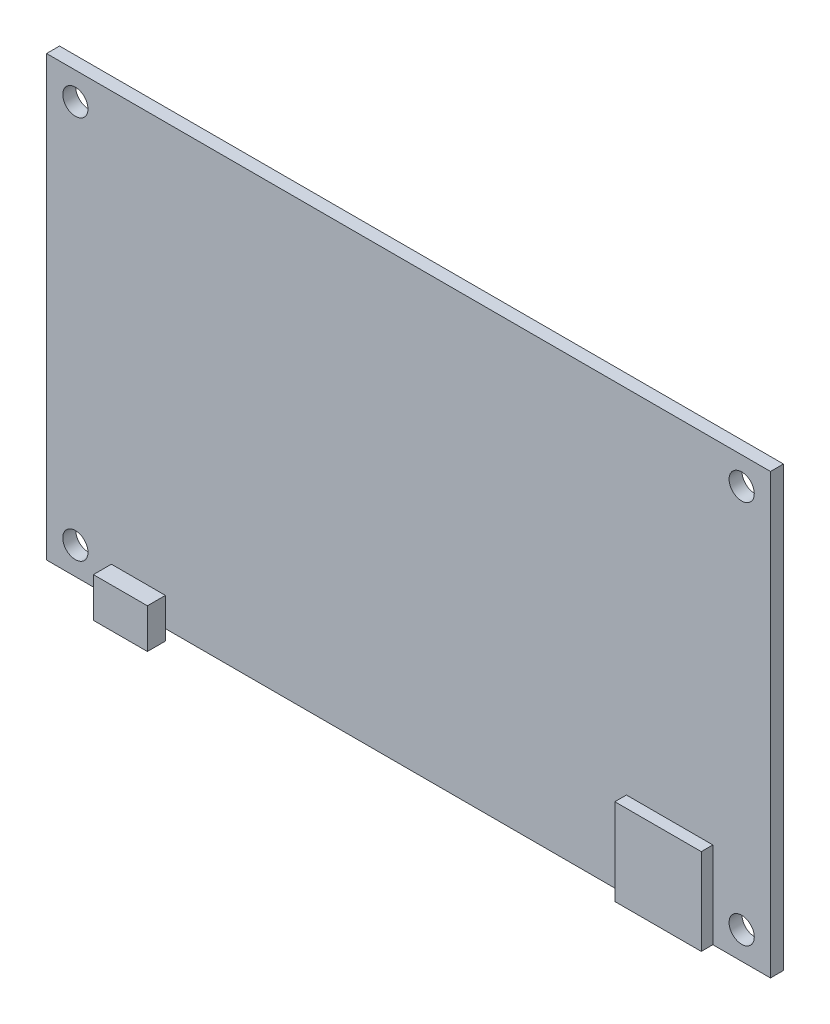
ISO-10303-21;
HEADER;
FILE_DESCRIPTION(('STEP AP214'),'2;1');
FILE_NAME('part.step','',(''),(''),'','','');
FILE_SCHEMA(('AUTOMOTIVE_DESIGN { 1 0 10303 214 1 1 1 1 }'));
ENDSEC;
DATA;
#1=APPLICATION_CONTEXT('core data for automotive mechanical design processes');
#2=APPLICATION_PROTOCOL_DEFINITION('international standard','automotive_design',2000,#1);
#3=PRODUCT_CONTEXT('',#1,'mechanical');
#4=PRODUCT('Part','Part','',(#3));
#5=PRODUCT_RELATED_PRODUCT_CATEGORY('part','',(#4));
#6=PRODUCT_DEFINITION_FORMATION('','',#4);
#7=PRODUCT_DEFINITION_CONTEXT('part definition',#1,'design');
#8=PRODUCT_DEFINITION('design','',#6,#7);
#9=PRODUCT_DEFINITION_SHAPE('','',#8);
#10=(LENGTH_UNIT() NAMED_UNIT(*) SI_UNIT(.MILLI.,.METRE.));
#11=(NAMED_UNIT(*) PLANE_ANGLE_UNIT() SI_UNIT($,.RADIAN.));
#12=(NAMED_UNIT(*) SI_UNIT($,.STERADIAN.) SOLID_ANGLE_UNIT());
#13=UNCERTAINTY_MEASURE_WITH_UNIT(LENGTH_MEASURE(1.E-05),#10,'distance_accuracy_value','');
#14=(GEOMETRIC_REPRESENTATION_CONTEXT(3) GLOBAL_UNCERTAINTY_ASSIGNED_CONTEXT((#13)) GLOBAL_UNIT_ASSIGNED_CONTEXT((#10,
#11,#12)) REPRESENTATION_CONTEXT('',''));
#15=CARTESIAN_POINT('',(0.,0.,0.));
#16=DIRECTION('',(0.,0.,1.));
#17=DIRECTION('',(1.,0.,0.));
#18=AXIS2_PLACEMENT_3D('',#15,#16,#17);
#19=CARTESIAN_POINT('',(-50.25,0.,1.8));
#20=DIRECTION('',(0.,0.,1.));
#21=DIRECTION('',(1.,0.,0.));
#22=AXIS2_PLACEMENT_3D('',#19,#20,#21);
#23=PLANE('',#22);
#24=CARTESIAN_POINT('',(46.25,57.1,1.8));
#25=DIRECTION('',(0.,0.,-1.));
#26=DIRECTION('',(1.,0.,0.));
#27=AXIS2_PLACEMENT_3D('',#24,#25,#26);
#28=CIRCLE('',#27,1.75);
#29=CARTESIAN_POINT('',(48.,57.1,1.8));
#30=VERTEX_POINT('',#29);
#31=EDGE_CURVE('E275',#30,#30,#28,.T.);
#32=ORIENTED_EDGE('',*,*,#31,.T.);
#33=EDGE_LOOP('',(#32));
#34=FACE_BOUND('',#33,.T.);
#35=CARTESIAN_POINT('',(-46.25,3.8,1.8));
#36=DIRECTION('',(0.,0.,1.));
#37=DIRECTION('',(1.,0.,0.));
#38=AXIS2_PLACEMENT_3D('',#35,#36,#37);
#39=CIRCLE('',#38,1.75);
#40=CARTESIAN_POINT('',(-44.5,3.8,1.8));
#41=VERTEX_POINT('',#40);
#42=EDGE_CURVE('E295',#41,#41,#39,.T.);
#43=ORIENTED_EDGE('',*,*,#42,.F.);
#44=EDGE_LOOP('',(#43));
#45=FACE_BOUND('',#44,.T.);
#46=CARTESIAN_POINT('',(-46.25,57.1,1.8));
#47=DIRECTION('',(0.,0.,1.));
#48=DIRECTION('',(-1.,0.,0.));
#49=AXIS2_PLACEMENT_3D('',#46,#47,#48);
#50=CIRCLE('',#49,1.75);
#51=CARTESIAN_POINT('',(-48.,57.1,1.8));
#52=VERTEX_POINT('',#51);
#53=EDGE_CURVE('E287',#52,#52,#50,.T.);
#54=ORIENTED_EDGE('',*,*,#53,.F.);
#55=EDGE_LOOP('',(#54));
#56=FACE_BOUND('',#55,.T.);
#57=CARTESIAN_POINT('',(46.25,3.8,1.8));
#58=DIRECTION('',(0.,0.,-1.));
#59=DIRECTION('',(-1.,0.,0.));
#60=AXIS2_PLACEMENT_3D('',#57,#58,#59);
#61=CIRCLE('',#60,1.75);
#62=CARTESIAN_POINT('',(44.5,3.8,1.8));
#63=VERTEX_POINT('',#62);
#64=EDGE_CURVE('E284',#63,#63,#61,.T.);
#65=ORIENTED_EDGE('',*,*,#64,.T.);
#66=EDGE_LOOP('',(#65));
#67=FACE_BOUND('',#66,.T.);
#68=DIRECTION('',(1.,0.,0.));
#69=VECTOR('',#68,1.);
#70=CARTESIAN_POINT('',(-50.25,0.,1.8));
#71=LINE('',#70,#69);
#72=CARTESIAN_POINT('',(-50.25,0.,1.8));
#73=VERTEX_POINT('',#72);
#74=CARTESIAN_POINT('',(-41.25,0.,1.8));
#75=VERTEX_POINT('',#74);
#76=EDGE_CURVE('E192',#73,#75,#71,.T.);
#77=ORIENTED_EDGE('',*,*,#76,.T.);
#78=DIRECTION('',(0.,-1.,0.));
#79=VECTOR('',#78,1.);
#80=CARTESIAN_POINT('',(-41.25,-1.5,1.8));
#81=LINE('',#80,#79);
#82=CARTESIAN_POINT('',(-41.25,4.,1.8));
#83=VERTEX_POINT('',#82);
#84=EDGE_CURVE('E59',#83,#75,#81,.T.);
#85=ORIENTED_EDGE('',*,*,#84,.F.);
#86=DIRECTION('',(-1.,0.,0.));
#87=VECTOR('',#86,1.);
#88=CARTESIAN_POINT('',(-41.25,4.,1.8));
#89=LINE('',#88,#87);
#90=CARTESIAN_POINT('',(-33.75,4.,1.8));
#91=VERTEX_POINT('',#90);
#92=EDGE_CURVE('E54',#91,#83,#89,.T.);
#93=ORIENTED_EDGE('',*,*,#92,.F.);
#94=DIRECTION('',(0.,1.,0.));
#95=VECTOR('',#94,1.);
#96=CARTESIAN_POINT('',(-33.75,-1.5,1.8));
#97=LINE('',#96,#95);
#98=CARTESIAN_POINT('',(-33.75,0.,1.8));
#99=VERTEX_POINT('',#98);
#100=EDGE_CURVE('E141',#99,#91,#97,.T.);
#101=ORIENTED_EDGE('',*,*,#100,.F.);
#102=CARTESIAN_POINT('',(30.25,0.,1.8));
#103=VERTEX_POINT('',#102);
#104=EDGE_CURVE('E40',#99,#103,#71,.T.);
#105=ORIENTED_EDGE('',*,*,#104,.T.);
#106=DIRECTION('',(0.,-1.,0.));
#107=VECTOR('',#106,1.);
#108=CARTESIAN_POINT('',(30.25,0.,1.8));
#109=LINE('',#108,#107);
#110=CARTESIAN_POINT('',(30.25,12.,1.8));
#111=VERTEX_POINT('',#110);
#112=EDGE_CURVE('E160',#111,#103,#109,.T.);
#113=ORIENTED_EDGE('',*,*,#112,.F.);
#114=DIRECTION('',(-1.,0.,0.));
#115=VECTOR('',#114,1.);
#116=CARTESIAN_POINT('',(30.25,12.,1.8));
#117=LINE('',#116,#115);
#118=CARTESIAN_POINT('',(42.25,12.,1.8));
#119=VERTEX_POINT('',#118);
#120=EDGE_CURVE('E175',#119,#111,#117,.T.);
#121=ORIENTED_EDGE('',*,*,#120,.F.);
#122=DIRECTION('',(0.,1.,0.));
#123=VECTOR('',#122,1.);
#124=CARTESIAN_POINT('',(42.25,0.,1.8));
#125=LINE('',#124,#123);
#126=CARTESIAN_POINT('',(42.25,0.,1.8));
#127=VERTEX_POINT('',#126);
#128=EDGE_CURVE('E262',#127,#119,#125,.T.);
#129=ORIENTED_EDGE('',*,*,#128,.F.);
#130=CARTESIAN_POINT('',(50.25,0.,1.8));
#131=VERTEX_POINT('',#130);
#132=EDGE_CURVE('E203',#127,#131,#71,.T.);
#133=ORIENTED_EDGE('',*,*,#132,.T.);
#134=DIRECTION('',(0.,1.,0.));
#135=VECTOR('',#134,1.);
#136=CARTESIAN_POINT('',(50.25,60.9,1.8));
#137=LINE('',#136,#135);
#138=CARTESIAN_POINT('',(50.25,60.9,1.8));
#139=VERTEX_POINT('',#138);
#140=EDGE_CURVE('E198',#131,#139,#137,.T.);
#141=ORIENTED_EDGE('',*,*,#140,.T.);
#142=DIRECTION('',(-1.,0.,0.));
#143=VECTOR('',#142,1.);
#144=CARTESIAN_POINT('',(-50.25,60.9,1.8));
#145=LINE('',#144,#143);
#146=CARTESIAN_POINT('',(-50.25,60.9,1.8));
#147=VERTEX_POINT('',#146);
#148=EDGE_CURVE('E216',#139,#147,#145,.T.);
#149=ORIENTED_EDGE('',*,*,#148,.T.);
#150=DIRECTION('',(0.,-1.,0.));
#151=VECTOR('',#150,1.);
#152=CARTESIAN_POINT('',(-50.25,60.9,1.8));
#153=LINE('',#152,#151);
#154=EDGE_CURVE('E196',#147,#73,#153,.T.);
#155=ORIENTED_EDGE('',*,*,#154,.T.);
#156=EDGE_LOOP('',(#77,#85,#93,#101,#105,#113,#121,#129,#133,#141,#149,#155));
#157=FACE_BOUND('',#156,.T.);
#158=ADVANCED_FACE('F36',(#34,#45,#56,#67,#157),#23,.T.);
#159=CARTESIAN_POINT('',(-50.25,0.,0.));
#160=DIRECTION('',(0.,0.,1.));
#161=DIRECTION('',(1.,0.,0.));
#162=AXIS2_PLACEMENT_3D('',#159,#160,#161);
#163=PLANE('',#162);
#164=CARTESIAN_POINT('',(46.25,3.8,0.));
#165=DIRECTION('',(0.,0.,1.));
#166=DIRECTION('',(1.,0.,0.));
#167=AXIS2_PLACEMENT_3D('',#164,#165,#166);
#168=CIRCLE('',#167,1.75);
#169=CARTESIAN_POINT('',(48.,3.8,0.));
#170=VERTEX_POINT('',#169);
#171=EDGE_CURVE('E282',#170,#170,#168,.T.);
#172=ORIENTED_EDGE('',*,*,#171,.T.);
#173=EDGE_LOOP('',(#172));
#174=FACE_BOUND('',#173,.T.);
#175=CARTESIAN_POINT('',(-46.25,57.1,0.));
#176=DIRECTION('',(0.,0.,1.));
#177=DIRECTION('',(1.,0.,0.));
#178=AXIS2_PLACEMENT_3D('',#175,#176,#177);
#179=CIRCLE('',#178,1.75);
#180=CARTESIAN_POINT('',(-44.5,57.1,0.));
#181=VERTEX_POINT('',#180);
#182=EDGE_CURVE('E292',#181,#181,#179,.F.);
#183=ORIENTED_EDGE('',*,*,#182,.F.);
#184=EDGE_LOOP('',(#183));
#185=FACE_BOUND('',#184,.T.);
#186=CARTESIAN_POINT('',(-46.25,3.8,0.));
#187=DIRECTION('',(0.,0.,1.));
#188=DIRECTION('',(1.,0.,0.));
#189=AXIS2_PLACEMENT_3D('',#186,#187,#188);
#190=CIRCLE('',#189,1.75);
#191=CARTESIAN_POINT('',(-44.5,3.8,0.));
#192=VERTEX_POINT('',#191);
#193=EDGE_CURVE('E225',#192,#192,#190,.F.);
#194=ORIENTED_EDGE('',*,*,#193,.F.);
#195=EDGE_LOOP('',(#194));
#196=FACE_BOUND('',#195,.T.);
#197=DIRECTION('',(0.,-1.,0.));
#198=VECTOR('',#197,1.);
#199=CARTESIAN_POINT('',(-50.25,60.9,0.));
#200=LINE('',#199,#198);
#201=CARTESIAN_POINT('',(-50.25,60.9,0.));
#202=VERTEX_POINT('',#201);
#203=CARTESIAN_POINT('',(-50.25,0.,0.));
#204=VERTEX_POINT('',#203);
#205=EDGE_CURVE('E223',#202,#204,#200,.T.);
#206=ORIENTED_EDGE('',*,*,#205,.F.);
#207=DIRECTION('',(-1.,0.,0.));
#208=VECTOR('',#207,1.);
#209=CARTESIAN_POINT('',(-50.25,60.9,0.));
#210=LINE('',#209,#208);
#211=CARTESIAN_POINT('',(50.25,60.9,0.));
#212=VERTEX_POINT('',#211);
#213=EDGE_CURVE('E217',#212,#202,#210,.T.);
#214=ORIENTED_EDGE('',*,*,#213,.F.);
#215=DIRECTION('',(0.,1.,0.));
#216=VECTOR('',#215,1.);
#217=CARTESIAN_POINT('',(50.25,60.9,0.));
#218=LINE('',#217,#216);
#219=CARTESIAN_POINT('',(50.25,0.,0.));
#220=VERTEX_POINT('',#219);
#221=EDGE_CURVE('E219',#220,#212,#218,.T.);
#222=ORIENTED_EDGE('',*,*,#221,.F.);
#223=DIRECTION('',(1.,0.,0.));
#224=VECTOR('',#223,1.);
#225=CARTESIAN_POINT('',(-50.25,0.,0.));
#226=LINE('',#225,#224);
#227=EDGE_CURVE('E221',#204,#220,#226,.T.);
#228=ORIENTED_EDGE('',*,*,#227,.F.);
#229=EDGE_LOOP('',(#206,#214,#222,#228));
#230=FACE_BOUND('',#229,.T.);
#231=CARTESIAN_POINT('',(46.25,57.1,0.));
#232=DIRECTION('',(0.,0.,1.));
#233=DIRECTION('',(1.,0.,0.));
#234=AXIS2_PLACEMENT_3D('',#231,#232,#233);
#235=CIRCLE('',#234,1.75);
#236=CARTESIAN_POINT('',(48.,57.1,0.));
#237=VERTEX_POINT('',#236);
#238=EDGE_CURVE('E273',#237,#237,#235,.T.);
#239=ORIENTED_EDGE('',*,*,#238,.T.);
#240=EDGE_LOOP('',(#239));
#241=FACE_BOUND('',#240,.T.);
#242=ADVANCED_FACE('F302',(#174,#185,#196,#230,#241),#163,.F.);
#243=CARTESIAN_POINT('',(-50.25,60.9,1.8));
#244=DIRECTION('',(1.,0.,0.));
#245=DIRECTION('',(0.,1.,0.));
#246=AXIS2_PLACEMENT_3D('',#243,#244,#245);
#247=PLANE('',#246);
#248=ORIENTED_EDGE('',*,*,#205,.T.);
#249=DIRECTION('',(0.,0.,-1.));
#250=VECTOR('',#249,1.);
#251=CARTESIAN_POINT('',(-50.25,0.,1.8));
#252=LINE('',#251,#250);
#253=EDGE_CURVE('E12',#73,#204,#252,.T.);
#254=ORIENTED_EDGE('',*,*,#253,.F.);
#255=ORIENTED_EDGE('',*,*,#154,.F.);
#256=DIRECTION('',(0.,0.,-1.));
#257=VECTOR('',#256,1.);
#258=CARTESIAN_POINT('',(-50.25,60.9,1.8));
#259=LINE('',#258,#257);
#260=EDGE_CURVE('E213',#147,#202,#259,.T.);
#261=ORIENTED_EDGE('',*,*,#260,.T.);
#262=EDGE_LOOP('',(#248,#254,#255,#261));
#263=FACE_BOUND('',#262,.T.);
#264=ADVANCED_FACE('F38',(#263),#247,.F.);
#265=CARTESIAN_POINT('',(-50.25,0.,1.8));
#266=DIRECTION('',(0.,1.,0.));
#267=DIRECTION('',(0.,0.,1.));
#268=AXIS2_PLACEMENT_3D('',#265,#266,#267);
#269=PLANE('',#268);
#270=ORIENTED_EDGE('',*,*,#227,.T.);
#271=DIRECTION('',(0.,0.,-1.));
#272=VECTOR('',#271,1.);
#273=CARTESIAN_POINT('',(50.25,0.,1.8));
#274=LINE('',#273,#272);
#275=EDGE_CURVE('E46',#131,#220,#274,.T.);
#276=ORIENTED_EDGE('',*,*,#275,.F.);
#277=ORIENTED_EDGE('',*,*,#132,.F.);
#278=DIRECTION('',(0.,0.,-1.));
#279=VECTOR('',#278,1.);
#280=CARTESIAN_POINT('',(42.25,0.,23.7905627484771));
#281=LINE('',#280,#279);
#282=CARTESIAN_POINT('',(42.25,0.,3.41));
#283=VERTEX_POINT('',#282);
#284=EDGE_CURVE('E253',#283,#127,#281,.T.);
#285=ORIENTED_EDGE('',*,*,#284,.F.);
#286=DIRECTION('',(1.,0.,0.));
#287=VECTOR('',#286,1.);
#288=CARTESIAN_POINT('',(30.25,0.,3.41));
#289=LINE('',#288,#287);
#290=CARTESIAN_POINT('',(30.25,0.,3.41));
#291=VERTEX_POINT('',#290);
#292=EDGE_CURVE('E249',#291,#283,#289,.T.);
#293=ORIENTED_EDGE('',*,*,#292,.F.);
#294=DIRECTION('',(0.,0.,-1.));
#295=VECTOR('',#294,1.);
#296=CARTESIAN_POINT('',(30.25,0.,23.7905627484771));
#297=LINE('',#296,#295);
#298=EDGE_CURVE('E187',#291,#103,#297,.T.);
#299=ORIENTED_EDGE('',*,*,#298,.T.);
#300=ORIENTED_EDGE('',*,*,#104,.F.);
#301=EDGE_CURVE('E190',#75,#99,#71,.T.);
#302=ORIENTED_EDGE('',*,*,#301,.F.);
#303=ORIENTED_EDGE('',*,*,#76,.F.);
#304=ORIENTED_EDGE('',*,*,#253,.T.);
#305=EDGE_LOOP('',(#270,#276,#277,#285,#293,#299,#300,#302,#303,#304));
#306=FACE_BOUND('',#305,.T.);
#307=ADVANCED_FACE('F246',(#306),#269,.F.);
#308=CARTESIAN_POINT('',(50.25,60.9,1.8));
#309=DIRECTION('',(-1.,0.,0.));
#310=DIRECTION('',(0.,0.,1.));
#311=AXIS2_PLACEMENT_3D('',#308,#309,#310);
#312=PLANE('',#311);
#313=ORIENTED_EDGE('',*,*,#221,.T.);
#314=DIRECTION('',(0.,0.,-1.));
#315=VECTOR('',#314,1.);
#316=CARTESIAN_POINT('',(50.25,60.9,1.8));
#317=LINE('',#316,#315);
#318=EDGE_CURVE('E210',#139,#212,#317,.T.);
#319=ORIENTED_EDGE('',*,*,#318,.F.);
#320=ORIENTED_EDGE('',*,*,#140,.F.);
#321=ORIENTED_EDGE('',*,*,#275,.T.);
#322=EDGE_LOOP('',(#313,#319,#320,#321));
#323=FACE_BOUND('',#322,.T.);
#324=ADVANCED_FACE('F234',(#323),#312,.F.);
#325=CARTESIAN_POINT('',(-50.25,60.9,1.8));
#326=DIRECTION('',(0.,-1.,0.));
#327=DIRECTION('',(0.,0.,-1.));
#328=AXIS2_PLACEMENT_3D('',#325,#326,#327);
#329=PLANE('',#328);
#330=ORIENTED_EDGE('',*,*,#213,.T.);
#331=ORIENTED_EDGE('',*,*,#260,.F.);
#332=ORIENTED_EDGE('',*,*,#148,.F.);
#333=ORIENTED_EDGE('',*,*,#318,.T.);
#334=EDGE_LOOP('',(#330,#331,#332,#333));
#335=FACE_BOUND('',#334,.T.);
#336=ADVANCED_FACE('F238',(#335),#329,.F.);
#337=CARTESIAN_POINT('',(-46.25,3.8,-0.000999999999999916));
#338=DIRECTION('',(0.,0.,1.));
#339=DIRECTION('',(1.,0.,0.));
#340=AXIS2_PLACEMENT_3D('',#337,#338,#339);
#341=CYLINDRICAL_SURFACE('',#340,1.75);
#342=ORIENTED_EDGE('',*,*,#42,.T.);
#343=EDGE_LOOP('',(#342));
#344=FACE_BOUND('',#343,.T.);
#345=ORIENTED_EDGE('',*,*,#193,.T.);
#346=EDGE_LOOP('',(#345));
#347=FACE_BOUND('',#346,.T.);
#348=ADVANCED_FACE('F300',(#344,#347),#341,.F.);
#349=CARTESIAN_POINT('',(-46.25,57.1,-0.000999999999999916));
#350=DIRECTION('',(0.,0.,1.));
#351=DIRECTION('',(1.,0.,0.));
#352=AXIS2_PLACEMENT_3D('',#349,#350,#351);
#353=CYLINDRICAL_SURFACE('',#352,1.75);
#354=ORIENTED_EDGE('',*,*,#53,.T.);
#355=EDGE_LOOP('',(#354));
#356=FACE_BOUND('',#355,.T.);
#357=ORIENTED_EDGE('',*,*,#182,.T.);
#358=EDGE_LOOP('',(#357));
#359=FACE_BOUND('',#358,.T.);
#360=ADVANCED_FACE('F320',(#356,#359),#353,.F.);
#361=CARTESIAN_POINT('',(46.25,3.8,-0.000999999999999916));
#362=DIRECTION('',(0.,0.,1.));
#363=DIRECTION('',(1.,0.,0.));
#364=AXIS2_PLACEMENT_3D('',#361,#362,#363);
#365=CYLINDRICAL_SURFACE('',#364,1.75);
#366=ORIENTED_EDGE('',*,*,#64,.F.);
#367=EDGE_LOOP('',(#366));
#368=FACE_BOUND('',#367,.T.);
#369=ORIENTED_EDGE('',*,*,#171,.F.);
#370=EDGE_LOOP('',(#369));
#371=FACE_BOUND('',#370,.T.);
#372=ADVANCED_FACE('F312',(#368,#371),#365,.F.);
#373=CARTESIAN_POINT('',(46.25,57.1,-0.000999999999999916));
#374=DIRECTION('',(0.,0.,1.));
#375=DIRECTION('',(1.,0.,0.));
#376=AXIS2_PLACEMENT_3D('',#373,#374,#375);
#377=CYLINDRICAL_SURFACE('',#376,1.75);
#378=ORIENTED_EDGE('',*,*,#31,.F.);
#379=EDGE_LOOP('',(#378));
#380=FACE_BOUND('',#379,.T.);
#381=ORIENTED_EDGE('',*,*,#238,.F.);
#382=EDGE_LOOP('',(#381));
#383=FACE_BOUND('',#382,.T.);
#384=ADVANCED_FACE('F310',(#380,#383),#377,.F.);
#385=CARTESIAN_POINT('',(30.25,0.,23.7905627484771));
#386=DIRECTION('',(1.,0.,0.));
#387=DIRECTION('',(0.,0.,-1.));
#388=AXIS2_PLACEMENT_3D('',#385,#386,#387);
#389=PLANE('',#388);
#390=DIRECTION('',(0.,-1.,0.));
#391=VECTOR('',#390,1.);
#392=CARTESIAN_POINT('',(30.25,0.,3.41));
#393=LINE('',#392,#391);
#394=CARTESIAN_POINT('',(30.25,12.,3.41));
#395=VERTEX_POINT('',#394);
#396=EDGE_CURVE('E255',#395,#291,#393,.T.);
#397=ORIENTED_EDGE('',*,*,#396,.F.);
#398=DIRECTION('',(0.,0.,-1.));
#399=VECTOR('',#398,1.);
#400=CARTESIAN_POINT('',(30.25,12.,23.7905627484771));
#401=LINE('',#400,#399);
#402=EDGE_CURVE('E157',#395,#111,#401,.T.);
#403=ORIENTED_EDGE('',*,*,#402,.T.);
#404=ORIENTED_EDGE('',*,*,#112,.T.);
#405=ORIENTED_EDGE('',*,*,#298,.F.);
#406=EDGE_LOOP('',(#397,#403,#404,#405));
#407=FACE_BOUND('',#406,.T.);
#408=ADVANCED_FACE('F254',(#407),#389,.F.);
#409=CARTESIAN_POINT('',(42.25,0.,23.7905627484771));
#410=DIRECTION('',(-1.,0.,0.));
#411=DIRECTION('',(0.,-1.,0.));
#412=AXIS2_PLACEMENT_3D('',#409,#410,#411);
#413=PLANE('',#412);
#414=DIRECTION('',(0.,1.,0.));
#415=VECTOR('',#414,1.);
#416=CARTESIAN_POINT('',(42.25,0.,3.41));
#417=LINE('',#416,#415);
#418=CARTESIAN_POINT('',(42.25,12.,3.41));
#419=VERTEX_POINT('',#418);
#420=EDGE_CURVE('E182',#283,#419,#417,.T.);
#421=ORIENTED_EDGE('',*,*,#420,.F.);
#422=ORIENTED_EDGE('',*,*,#284,.T.);
#423=ORIENTED_EDGE('',*,*,#128,.T.);
#424=DIRECTION('',(0.,0.,-1.));
#425=VECTOR('',#424,1.);
#426=CARTESIAN_POINT('',(42.25,12.,23.7905627484771));
#427=LINE('',#426,#425);
#428=EDGE_CURVE('E179',#419,#119,#427,.T.);
#429=ORIENTED_EDGE('',*,*,#428,.F.);
#430=EDGE_LOOP('',(#421,#422,#423,#429));
#431=FACE_BOUND('',#430,.T.);
#432=ADVANCED_FACE('F265',(#431),#413,.F.);
#433=CARTESIAN_POINT('',(30.25,12.,23.7905627484771));
#434=DIRECTION('',(0.,-1.,0.));
#435=DIRECTION('',(0.,0.,-1.));
#436=AXIS2_PLACEMENT_3D('',#433,#434,#435);
#437=PLANE('',#436);
#438=DIRECTION('',(-1.,0.,0.));
#439=VECTOR('',#438,1.);
#440=CARTESIAN_POINT('',(30.25,12.,3.41));
#441=LINE('',#440,#439);
#442=EDGE_CURVE('E178',#419,#395,#441,.T.);
#443=ORIENTED_EDGE('',*,*,#442,.F.);
#444=ORIENTED_EDGE('',*,*,#428,.T.);
#445=ORIENTED_EDGE('',*,*,#120,.T.);
#446=ORIENTED_EDGE('',*,*,#402,.F.);
#447=EDGE_LOOP('',(#443,#444,#445,#446));
#448=FACE_BOUND('',#447,.T.);
#449=ADVANCED_FACE('F260',(#448),#437,.F.);
#450=CARTESIAN_POINT('',(-50.25,0.,3.41));
#451=DIRECTION('',(0.,0.,1.));
#452=DIRECTION('',(1.,0.,0.));
#453=AXIS2_PLACEMENT_3D('',#450,#451,#452);
#454=PLANE('',#453);
#455=ORIENTED_EDGE('',*,*,#442,.T.);
#456=ORIENTED_EDGE('',*,*,#396,.T.);
#457=ORIENTED_EDGE('',*,*,#292,.T.);
#458=ORIENTED_EDGE('',*,*,#420,.T.);
#459=EDGE_LOOP('',(#455,#456,#457,#458));
#460=FACE_BOUND('',#459,.T.);
#461=ADVANCED_FACE('F390',(#460),#454,.T.);
#462=CARTESIAN_POINT('',(-41.25,4.,1.8));
#463=DIRECTION('',(0.,0.,-1.));
#464=DIRECTION('',(-1.,0.,0.));
#465=AXIS2_PLACEMENT_3D('',#462,#463,#464);
#466=PLANE('',#465);
#467=ORIENTED_EDGE('',*,*,#301,.T.);
#468=CARTESIAN_POINT('',(-33.75,-1.5,1.8));
#469=VERTEX_POINT('',#468);
#470=EDGE_CURVE('E143',#469,#99,#97,.T.);
#471=ORIENTED_EDGE('',*,*,#470,.F.);
#472=DIRECTION('',(1.,0.,0.));
#473=VECTOR('',#472,1.);
#474=CARTESIAN_POINT('',(-41.25,-1.5,1.8));
#475=LINE('',#474,#473);
#476=CARTESIAN_POINT('',(-41.25,-1.5,1.8));
#477=VERTEX_POINT('',#476);
#478=EDGE_CURVE('E170',#477,#469,#475,.T.);
#479=ORIENTED_EDGE('',*,*,#478,.F.);
#480=EDGE_CURVE('E174',#75,#477,#81,.T.);
#481=ORIENTED_EDGE('',*,*,#480,.F.);
#482=EDGE_LOOP('',(#467,#471,#479,#481));
#483=FACE_BOUND('',#482,.T.);
#484=ADVANCED_FACE('F398',(#483),#466,.T.);
#485=CARTESIAN_POINT('',(-41.25,-1.5,17.9005376188691));
#486=DIRECTION('',(1.,0.,0.));
#487=DIRECTION('',(0.,0.,-1.));
#488=AXIS2_PLACEMENT_3D('',#485,#486,#487);
#489=PLANE('',#488);
#490=DIRECTION('',(0.,-1.,0.));
#491=VECTOR('',#490,1.);
#492=CARTESIAN_POINT('',(-41.25,-1.5,4.3));
#493=LINE('',#492,#491);
#494=CARTESIAN_POINT('',(-41.25,4.,4.3));
#495=VERTEX_POINT('',#494);
#496=CARTESIAN_POINT('',(-41.25,-1.5,4.3));
#497=VERTEX_POINT('',#496);
#498=EDGE_CURVE('E152',#495,#497,#493,.T.);
#499=ORIENTED_EDGE('',*,*,#498,.F.);
#500=DIRECTION('',(0.,0.,-1.));
#501=VECTOR('',#500,1.);
#502=CARTESIAN_POINT('',(-41.25,4.,17.9005376188691));
#503=LINE('',#502,#501);
#504=EDGE_CURVE('E148',#495,#83,#503,.T.);
#505=ORIENTED_EDGE('',*,*,#504,.T.);
#506=ORIENTED_EDGE('',*,*,#84,.T.);
#507=ORIENTED_EDGE('',*,*,#480,.T.);
#508=DIRECTION('',(0.,0.,-1.));
#509=VECTOR('',#508,1.);
#510=CARTESIAN_POINT('',(-41.25,-1.5,17.9005376188691));
#511=LINE('',#510,#509);
#512=EDGE_CURVE('E167',#497,#477,#511,.T.);
#513=ORIENTED_EDGE('',*,*,#512,.F.);
#514=EDGE_LOOP('',(#499,#505,#506,#507,#513));
#515=FACE_BOUND('',#514,.T.);
#516=ADVANCED_FACE('F415',(#515),#489,.F.);
#517=CARTESIAN_POINT('',(-41.25,-1.5,17.9005376188691));
#518=DIRECTION('',(0.,1.,0.));
#519=DIRECTION('',(0.,0.,1.));
#520=AXIS2_PLACEMENT_3D('',#517,#518,#519);
#521=PLANE('',#520);
#522=DIRECTION('',(1.,0.,0.));
#523=VECTOR('',#522,1.);
#524=CARTESIAN_POINT('',(-41.25,-1.5,4.3));
#525=LINE('',#524,#523);
#526=CARTESIAN_POINT('',(-33.75,-1.5,4.3));
#527=VERTEX_POINT('',#526);
#528=EDGE_CURVE('E156',#497,#527,#525,.T.);
#529=ORIENTED_EDGE('',*,*,#528,.F.);
#530=ORIENTED_EDGE('',*,*,#512,.T.);
#531=ORIENTED_EDGE('',*,*,#478,.T.);
#532=DIRECTION('',(0.,0.,-1.));
#533=VECTOR('',#532,1.);
#534=CARTESIAN_POINT('',(-33.75,-1.5,17.9005376188691));
#535=LINE('',#534,#533);
#536=EDGE_CURVE('E171',#527,#469,#535,.T.);
#537=ORIENTED_EDGE('',*,*,#536,.F.);
#538=EDGE_LOOP('',(#529,#530,#531,#537));
#539=FACE_BOUND('',#538,.T.);
#540=ADVANCED_FACE('F425',(#539),#521,.F.);
#541=CARTESIAN_POINT('',(-33.75,-1.5,17.9005376188691));
#542=DIRECTION('',(-1.,0.,0.));
#543=DIRECTION('',(0.,0.,1.));
#544=AXIS2_PLACEMENT_3D('',#541,#542,#543);
#545=PLANE('',#544);
#546=DIRECTION('',(0.,1.,0.));
#547=VECTOR('',#546,1.);
#548=CARTESIAN_POINT('',(-33.75,-1.5,4.3));
#549=LINE('',#548,#547);
#550=CARTESIAN_POINT('',(-33.75,4.,4.3));
#551=VERTEX_POINT('',#550);
#552=EDGE_CURVE('E138',#527,#551,#549,.T.);
#553=ORIENTED_EDGE('',*,*,#552,.F.);
#554=ORIENTED_EDGE('',*,*,#536,.T.);
#555=ORIENTED_EDGE('',*,*,#470,.T.);
#556=ORIENTED_EDGE('',*,*,#100,.T.);
#557=DIRECTION('',(0.,0.,-1.));
#558=VECTOR('',#557,1.);
#559=CARTESIAN_POINT('',(-33.75,4.,17.9005376188691));
#560=LINE('',#559,#558);
#561=EDGE_CURVE('E134',#551,#91,#560,.T.);
#562=ORIENTED_EDGE('',*,*,#561,.F.);
#563=EDGE_LOOP('',(#553,#554,#555,#556,#562));
#564=FACE_BOUND('',#563,.T.);
#565=ADVANCED_FACE('F136',(#564),#545,.F.);
#566=CARTESIAN_POINT('',(-41.25,4.,17.9005376188691));
#567=DIRECTION('',(0.,-1.,0.));
#568=DIRECTION('',(0.,0.,-1.));
#569=AXIS2_PLACEMENT_3D('',#566,#567,#568);
#570=PLANE('',#569);
#571=DIRECTION('',(-1.,0.,0.));
#572=VECTOR('',#571,1.);
#573=CARTESIAN_POINT('',(-41.25,4.,4.3));
#574=LINE('',#573,#572);
#575=EDGE_CURVE('E146',#551,#495,#574,.T.);
#576=ORIENTED_EDGE('',*,*,#575,.F.);
#577=ORIENTED_EDGE('',*,*,#561,.T.);
#578=ORIENTED_EDGE('',*,*,#92,.T.);
#579=ORIENTED_EDGE('',*,*,#504,.F.);
#580=EDGE_LOOP('',(#576,#577,#578,#579));
#581=FACE_BOUND('',#580,.T.);
#582=ADVANCED_FACE('F147',(#581),#570,.F.);
#583=CARTESIAN_POINT('',(-50.25,0.,4.3));
#584=DIRECTION('',(0.,0.,1.));
#585=DIRECTION('',(1.,0.,0.));
#586=AXIS2_PLACEMENT_3D('',#583,#584,#585);
#587=PLANE('',#586);
#588=ORIENTED_EDGE('',*,*,#575,.T.);
#589=ORIENTED_EDGE('',*,*,#498,.T.);
#590=ORIENTED_EDGE('',*,*,#528,.T.);
#591=ORIENTED_EDGE('',*,*,#552,.T.);
#592=EDGE_LOOP('',(#588,#589,#590,#591));
#593=FACE_BOUND('',#592,.T.);
#594=ADVANCED_FACE('F155',(#593),#587,.T.);
#595=CLOSED_SHELL('',(#158,#242,#264,#307,#324,#336,#348,#360,#372,#384,#408,#432,#449,#461,
#484,#516,#540,#565,#582,#594));
#596=MANIFOLD_SOLID_BREP('B2',#595);
#597=ADVANCED_BREP_SHAPE_REPRESENTATION('',(#18,#596),#14);
#598=SHAPE_DEFINITION_REPRESENTATION(#9,#597);
ENDSEC;
END-ISO-10303-21;
